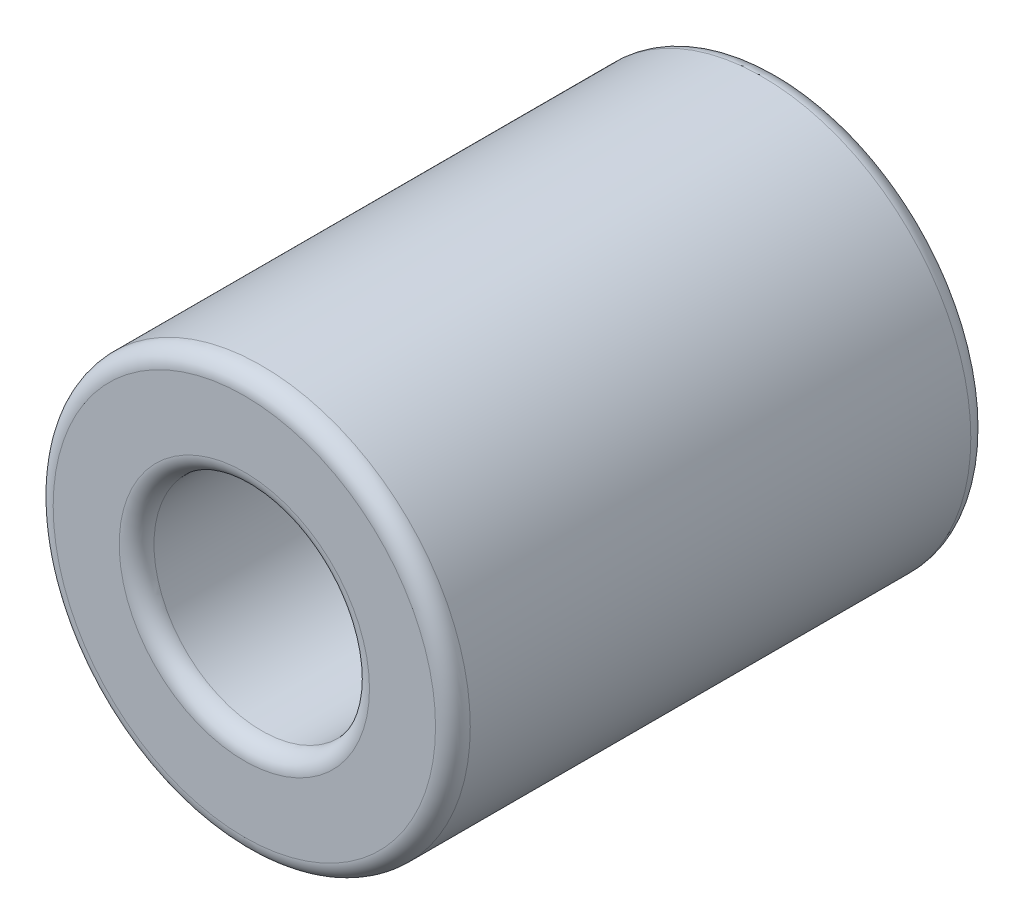
ISO-10303-21;
HEADER;
FILE_DESCRIPTION(('STEP AP214'),'2;1');
FILE_NAME('part.step','',(''),(''),'','','');
FILE_SCHEMA(('AUTOMOTIVE_DESIGN { 1 0 10303 214 1 1 1 1 }'));
ENDSEC;
DATA;
#1=APPLICATION_CONTEXT('core data for automotive mechanical design processes');
#2=APPLICATION_PROTOCOL_DEFINITION('international standard','automotive_design',2000,#1);
#3=PRODUCT_CONTEXT('',#1,'mechanical');
#4=PRODUCT('Part','Part','',(#3));
#5=PRODUCT_RELATED_PRODUCT_CATEGORY('part','',(#4));
#6=PRODUCT_DEFINITION_FORMATION('','',#4);
#7=PRODUCT_DEFINITION_CONTEXT('part definition',#1,'design');
#8=PRODUCT_DEFINITION('design','',#6,#7);
#9=PRODUCT_DEFINITION_SHAPE('','',#8);
#10=(LENGTH_UNIT() NAMED_UNIT(*) SI_UNIT(.MILLI.,.METRE.));
#11=(NAMED_UNIT(*) PLANE_ANGLE_UNIT() SI_UNIT($,.RADIAN.));
#12=(NAMED_UNIT(*) SI_UNIT($,.STERADIAN.) SOLID_ANGLE_UNIT());
#13=UNCERTAINTY_MEASURE_WITH_UNIT(LENGTH_MEASURE(1.E-05),#10,'distance_accuracy_value','');
#14=(GEOMETRIC_REPRESENTATION_CONTEXT(3) GLOBAL_UNCERTAINTY_ASSIGNED_CONTEXT((#13)) GLOBAL_UNIT_ASSIGNED_CONTEXT((#10,
#11,#12)) REPRESENTATION_CONTEXT('',''));
#15=CARTESIAN_POINT('',(0.,0.,0.));
#16=DIRECTION('',(0.,0.,1.));
#17=DIRECTION('',(1.,0.,0.));
#18=AXIS2_PLACEMENT_3D('',#15,#16,#17);
#19=CARTESIAN_POINT('',(0.,0.,7.7));
#20=DIRECTION('',(0.,0.,1.));
#21=DIRECTION('',(1.,0.,0.));
#22=AXIS2_PLACEMENT_3D('',#19,#20,#21);
#23=PLANE('',#22);
#24=CARTESIAN_POINT('',(0.,0.,7.7));
#25=DIRECTION('',(0.,0.,1.));
#26=DIRECTION('',(1.,0.,0.));
#27=AXIS2_PLACEMENT_3D('',#24,#25,#26);
#28=CIRCLE('',#27,1.8);
#29=CARTESIAN_POINT('',(1.8,0.,7.7));
#30=VERTEX_POINT('',#29);
#31=EDGE_CURVE('E42',#30,#30,#28,.F.);
#32=ORIENTED_EDGE('',*,*,#31,.T.);
#33=EDGE_LOOP('',(#32));
#34=FACE_BOUND('',#33,.T.);
#35=CARTESIAN_POINT('',(0.,0.,7.7));
#36=DIRECTION('',(0.,0.,1.));
#37=DIRECTION('',(1.,0.,0.));
#38=AXIS2_PLACEMENT_3D('',#35,#36,#37);
#39=CIRCLE('',#38,2.75);
#40=CARTESIAN_POINT('',(2.75,0.,7.7));
#41=VERTEX_POINT('',#40);
#42=EDGE_CURVE('E46',#41,#41,#39,.T.);
#43=ORIENTED_EDGE('',*,*,#42,.T.);
#44=EDGE_LOOP('',(#43));
#45=FACE_BOUND('',#44,.T.);
#46=ADVANCED_FACE('F31',(#34,#45),#23,.T.);
#47=CARTESIAN_POINT('',(0.,0.,0.));
#48=DIRECTION('',(0.,0.,1.));
#49=DIRECTION('',(1.,0.,0.));
#50=AXIS2_PLACEMENT_3D('',#47,#48,#49);
#51=PLANE('',#50);
#52=CARTESIAN_POINT('',(0.,0.,0.));
#53=DIRECTION('',(0.,0.,1.));
#54=DIRECTION('',(1.,0.,0.));
#55=AXIS2_PLACEMENT_3D('',#52,#53,#54);
#56=CIRCLE('',#55,1.8);
#57=CARTESIAN_POINT('',(1.8,0.,0.));
#58=VERTEX_POINT('',#57);
#59=EDGE_CURVE('E57',#58,#58,#56,.T.);
#60=ORIENTED_EDGE('',*,*,#59,.T.);
#61=EDGE_LOOP('',(#60));
#62=FACE_BOUND('',#61,.T.);
#63=CARTESIAN_POINT('',(0.,0.,0.));
#64=DIRECTION('',(0.,0.,1.));
#65=DIRECTION('',(1.,0.,0.));
#66=AXIS2_PLACEMENT_3D('',#63,#64,#65);
#67=CIRCLE('',#66,2.75);
#68=CARTESIAN_POINT('',(2.75,0.,0.));
#69=VERTEX_POINT('',#68);
#70=EDGE_CURVE('E60',#69,#69,#67,.F.);
#71=ORIENTED_EDGE('',*,*,#70,.T.);
#72=EDGE_LOOP('',(#71));
#73=FACE_BOUND('',#72,.T.);
#74=ADVANCED_FACE('F64',(#62,#73),#51,.F.);
#75=CARTESIAN_POINT('',(0.,0.,7.7));
#76=DIRECTION('',(0.,0.,-1.));
#77=DIRECTION('',(-1.,0.,0.));
#78=AXIS2_PLACEMENT_3D('',#75,#76,#77);
#79=CYLINDRICAL_SURFACE('',#78,3.);
#80=CARTESIAN_POINT('',(0.,0.,0.25));
#81=DIRECTION('',(0.,0.,1.));
#82=DIRECTION('',(1.,0.,0.));
#83=AXIS2_PLACEMENT_3D('',#80,#81,#82);
#84=CIRCLE('',#83,3.);
#85=CARTESIAN_POINT('',(3.,0.,0.25));
#86=VERTEX_POINT('',#85);
#87=EDGE_CURVE('E10',#86,#86,#84,.T.);
#88=ORIENTED_EDGE('',*,*,#87,.T.);
#89=EDGE_LOOP('',(#88));
#90=FACE_BOUND('',#89,.T.);
#91=CARTESIAN_POINT('',(0.,0.,7.45));
#92=DIRECTION('',(0.,0.,1.));
#93=DIRECTION('',(1.,0.,0.));
#94=AXIS2_PLACEMENT_3D('',#91,#92,#93);
#95=CIRCLE('',#94,3.);
#96=CARTESIAN_POINT('',(3.,0.,7.45));
#97=VERTEX_POINT('',#96);
#98=EDGE_CURVE('E38',#97,#97,#95,.F.);
#99=ORIENTED_EDGE('',*,*,#98,.T.);
#100=EDGE_LOOP('',(#99));
#101=FACE_BOUND('',#100,.T.);
#102=ADVANCED_FACE('F84',(#90,#101),#79,.T.);
#103=CARTESIAN_POINT('',(0.,0.,7.7));
#104=DIRECTION('',(0.,0.,-1.));
#105=DIRECTION('',(-1.,0.,0.));
#106=AXIS2_PLACEMENT_3D('',#103,#104,#105);
#107=CYLINDRICAL_SURFACE('',#106,1.55);
#108=CARTESIAN_POINT('',(0.,0.,0.25));
#109=DIRECTION('',(0.,0.,1.));
#110=DIRECTION('',(1.,0.,0.));
#111=AXIS2_PLACEMENT_3D('',#108,#109,#110);
#112=CIRCLE('',#111,1.55);
#113=CARTESIAN_POINT('',(1.55,0.,0.25));
#114=VERTEX_POINT('',#113);
#115=EDGE_CURVE('E51',#114,#114,#112,.F.);
#116=ORIENTED_EDGE('',*,*,#115,.T.);
#117=EDGE_LOOP('',(#116));
#118=FACE_BOUND('',#117,.T.);
#119=CARTESIAN_POINT('',(0.,0.,7.45));
#120=DIRECTION('',(0.,0.,1.));
#121=DIRECTION('',(1.,0.,0.));
#122=AXIS2_PLACEMENT_3D('',#119,#120,#121);
#123=CIRCLE('',#122,1.55);
#124=CARTESIAN_POINT('',(1.55,0.,7.45));
#125=VERTEX_POINT('',#124);
#126=EDGE_CURVE('E54',#125,#125,#123,.T.);
#127=ORIENTED_EDGE('',*,*,#126,.T.);
#128=EDGE_LOOP('',(#127));
#129=FACE_BOUND('',#128,.T.);
#130=ADVANCED_FACE('F89',(#118,#129),#107,.F.);
#131=CARTESIAN_POINT('',(0.,0.,0.25));
#132=DIRECTION('',(0.,0.,1.));
#133=DIRECTION('',(1.,0.,0.));
#134=AXIS2_PLACEMENT_3D('',#131,#132,#133);
#135=TOROIDAL_SURFACE('',#134,1.8,0.25);
#136=ORIENTED_EDGE('',*,*,#115,.F.);
#137=EDGE_LOOP('',(#136));
#138=FACE_BOUND('',#137,.T.);
#139=ORIENTED_EDGE('',*,*,#59,.F.);
#140=EDGE_LOOP('',(#139));
#141=FACE_BOUND('',#140,.T.);
#142=ADVANCED_FACE('F75',(#138,#141),#135,.T.);
#143=CARTESIAN_POINT('',(0.,0.,7.45));
#144=DIRECTION('',(0.,0.,1.));
#145=DIRECTION('',(1.,0.,0.));
#146=AXIS2_PLACEMENT_3D('',#143,#144,#145);
#147=TOROIDAL_SURFACE('',#146,1.8,0.25);
#148=ORIENTED_EDGE('',*,*,#31,.F.);
#149=EDGE_LOOP('',(#148));
#150=FACE_BOUND('',#149,.T.);
#151=ORIENTED_EDGE('',*,*,#126,.F.);
#152=EDGE_LOOP('',(#151));
#153=FACE_BOUND('',#152,.T.);
#154=ADVANCED_FACE('F69',(#150,#153),#147,.T.);
#155=CARTESIAN_POINT('',(0.,0.,0.25));
#156=DIRECTION('',(0.,0.,1.));
#157=DIRECTION('',(1.,0.,0.));
#158=AXIS2_PLACEMENT_3D('',#155,#156,#157);
#159=TOROIDAL_SURFACE('',#158,2.75,0.25);
#160=ORIENTED_EDGE('',*,*,#70,.F.);
#161=EDGE_LOOP('',(#160));
#162=FACE_BOUND('',#161,.T.);
#163=ORIENTED_EDGE('',*,*,#87,.F.);
#164=EDGE_LOOP('',(#163));
#165=FACE_BOUND('',#164,.T.);
#166=ADVANCED_FACE('F66',(#162,#165),#159,.T.);
#167=CARTESIAN_POINT('',(0.,0.,7.45));
#168=DIRECTION('',(0.,0.,1.));
#169=DIRECTION('',(1.,0.,0.));
#170=AXIS2_PLACEMENT_3D('',#167,#168,#169);
#171=TOROIDAL_SURFACE('',#170,2.75,0.25);
#172=ORIENTED_EDGE('',*,*,#98,.F.);
#173=EDGE_LOOP('',(#172));
#174=FACE_BOUND('',#173,.T.);
#175=ORIENTED_EDGE('',*,*,#42,.F.);
#176=EDGE_LOOP('',(#175));
#177=FACE_BOUND('',#176,.T.);
#178=ADVANCED_FACE('F33',(#174,#177),#171,.T.);
#179=CLOSED_SHELL('',(#46,#74,#102,#130,#142,#154,#166,#178));
#180=MANIFOLD_SOLID_BREP('B2',#179);
#181=ADVANCED_BREP_SHAPE_REPRESENTATION('',(#18,#180),#14);
#182=SHAPE_DEFINITION_REPRESENTATION(#9,#181);
ENDSEC;
END-ISO-10303-21;
